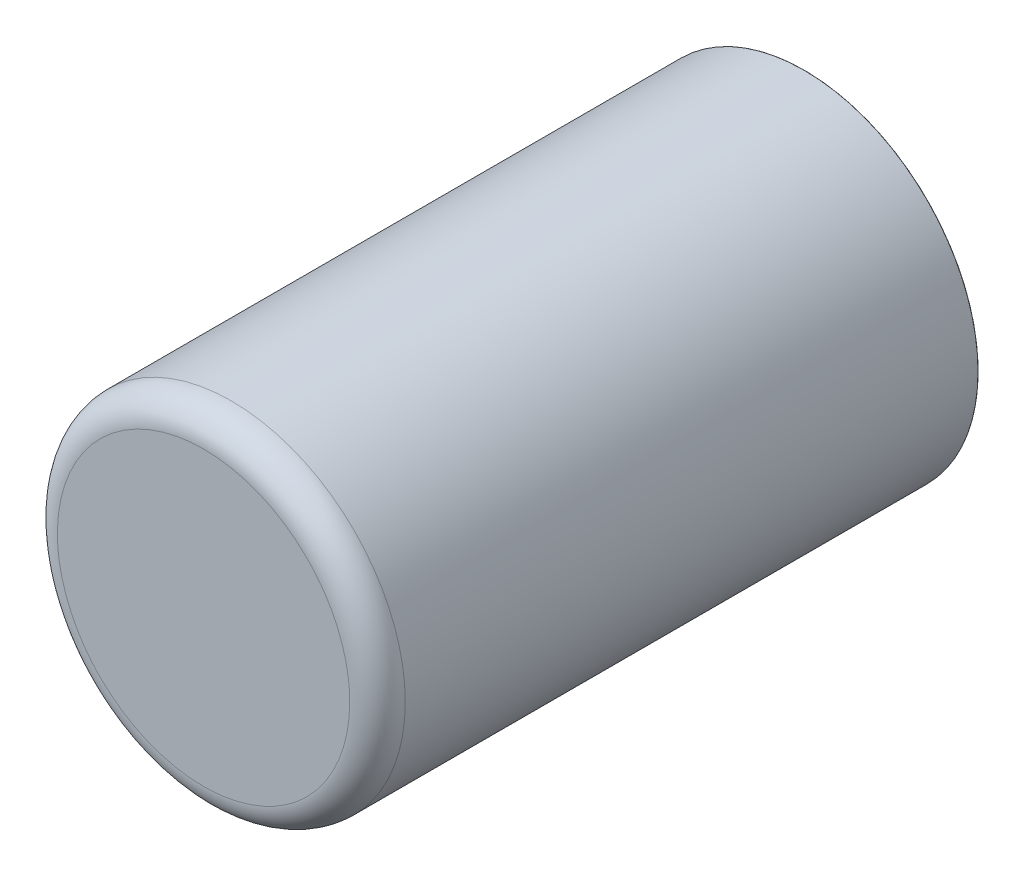
ISO-10303-21;
HEADER;
FILE_DESCRIPTION(('STEP AP214'),'2;1');
FILE_NAME('part.step','',(''),(''),'','','');
FILE_SCHEMA(('AUTOMOTIVE_DESIGN { 1 0 10303 214 1 1 1 1 }'));
ENDSEC;
DATA;
#1=APPLICATION_CONTEXT('core data for automotive mechanical design processes');
#2=APPLICATION_PROTOCOL_DEFINITION('international standard','automotive_design',2000,#1);
#3=PRODUCT_CONTEXT('',#1,'mechanical');
#4=PRODUCT('Part','Part','',(#3));
#5=PRODUCT_RELATED_PRODUCT_CATEGORY('part','',(#4));
#6=PRODUCT_DEFINITION_FORMATION('','',#4);
#7=PRODUCT_DEFINITION_CONTEXT('part definition',#1,'design');
#8=PRODUCT_DEFINITION('design','',#6,#7);
#9=PRODUCT_DEFINITION_SHAPE('','',#8);
#10=(LENGTH_UNIT() NAMED_UNIT(*) SI_UNIT(.MILLI.,.METRE.));
#11=(NAMED_UNIT(*) PLANE_ANGLE_UNIT() SI_UNIT($,.RADIAN.));
#12=(NAMED_UNIT(*) SI_UNIT($,.STERADIAN.) SOLID_ANGLE_UNIT());
#13=UNCERTAINTY_MEASURE_WITH_UNIT(LENGTH_MEASURE(1.E-05),#10,'distance_accuracy_value','');
#14=(GEOMETRIC_REPRESENTATION_CONTEXT(3) GLOBAL_UNCERTAINTY_ASSIGNED_CONTEXT((#13)) GLOBAL_UNIT_ASSIGNED_CONTEXT((#10,
#11,#12)) REPRESENTATION_CONTEXT('',''));
#15=CARTESIAN_POINT('',(0.,0.,0.));
#16=DIRECTION('',(0.,0.,1.));
#17=DIRECTION('',(1.,0.,0.));
#18=AXIS2_PLACEMENT_3D('',#15,#16,#17);
#19=CARTESIAN_POINT('',(-110.435261655171,-75.8999546142996,2.66200106833791));
#20=DIRECTION('',(0.,0.,1.));
#21=DIRECTION('',(1.,0.,0.));
#22=AXIS2_PLACEMENT_3D('',#19,#20,#21);
#23=PLANE('',#22);
#24=CARTESIAN_POINT('',(-110.435261655171,-75.8999546142996,2.6620010683379));
#25=DIRECTION('',(0.,0.,-1.));
#26=DIRECTION('',(-1.,0.,0.));
#27=AXIS2_PLACEMENT_3D('',#24,#25,#26);
#28=CIRCLE('',#27,2.37683452338597);
#29=CARTESIAN_POINT('',(-112.812096178557,-75.8999546142996,2.6620010683379));
#30=VERTEX_POINT('',#29);
#31=EDGE_CURVE('E22',#30,#30,#28,.T.);
#32=ORIENTED_EDGE('',*,*,#31,.T.);
#33=EDGE_LOOP('',(#32));
#34=FACE_BOUND('',#33,.T.);
#35=ADVANCED_FACE('F17',(#34),#23,.F.);
#36=CARTESIAN_POINT('',(-109.435261655171,-75.8999546142996,10.8846821663603));
#37=DIRECTION('',(0.,0.,1.));
#38=DIRECTION('',(1.,0.,0.));
#39=AXIS2_PLACEMENT_3D('',#36,#37,#38);
#40=PLANE('',#39);
#41=CARTESIAN_POINT('',(-110.435261655171,-77.8999546142996,10.8846821663603));
#42=CARTESIAN_POINT('',(-110.465904588904,-77.8999551480532,10.8846821663603));
#43=CARTESIAN_POINT('',(-110.496547480114,-77.8992503923736,10.8846821663603));
#44=CARTESIAN_POINT('',(-110.557768556746,-77.8964341344223,10.8846821663603));
#45=CARTESIAN_POINT('',(-110.588346742167,-77.8943226321504,10.8846821663603));
#46=CARTESIAN_POINT('',(-110.649373786479,-77.8886967132883,10.8846821663603));
#47=CARTESIAN_POINT('',(-110.679822645371,-77.885182296698,10.8846821663603));
#48=CARTESIAN_POINT('',(-110.740526725687,-77.8767581411369,10.8846821663603));
#49=CARTESIAN_POINT('',(-110.770781947112,-77.8718484021661,10.8846821663603));
#50=CARTESIAN_POINT('',(-110.831034840782,-77.8606439278679,10.8846821663603));
#51=CARTESIAN_POINT('',(-110.861032513027,-77.8543491925405,10.8846821663603));
#52=CARTESIAN_POINT('',(-110.920706943266,-77.8403880342324,10.8846821663603));
#53=CARTESIAN_POINT('',(-110.950383701261,-77.8327216112518,10.8846821663603));
#54=CARTESIAN_POINT('',(-111.009353615184,-77.8160332688263,10.8846821663603));
#55=CARTESIAN_POINT('',(-111.038646771113,-77.8070113493815,10.8846821663603));
#56=CARTESIAN_POINT('',(-111.096787603297,-77.7876310714197,10.8846821663603));
#57=CARTESIAN_POINT('',(-111.125635279551,-77.7772727129029,10.8846821663603));
#58=CARTESIAN_POINT('',(-111.182824216795,-77.7552414405414,10.8846821663603));
#59=CARTESIAN_POINT('',(-111.211165477784,-77.7435685266967,10.8846821663604));
#60=CARTESIAN_POINT('',(-111.267281714701,-77.7189327880121,10.8846821663603));
#61=CARTESIAN_POINT('',(-111.295056690629,-77.7059699631722,10.8846821663601));
#62=CARTESIAN_POINT('',(-111.349981698533,-77.6787818331058,10.8846821663605));
#63=CARTESIAN_POINT('',(-111.37713173051,-77.6645565278794,10.884682166361));
#64=CARTESIAN_POINT('',(-111.430749456801,-77.6348733045376,10.8846821663596));
#65=CARTESIAN_POINT('',(-111.457217151117,-77.6194153864222,10.8846821663579));
#66=CARTESIAN_POINT('',(-111.509414454686,-77.5873002666312,10.8846821663627));
#67=CARTESIAN_POINT('',(-111.53514406394,-77.5706430649555,10.8846821663694));
#68=CARTESIAN_POINT('',(-111.585810244106,-77.5361620381118,10.8846821663512));
#69=CARTESIAN_POINT('',(-111.610746815018,-77.5183382129436,10.8846821663262));
#70=CARTESIAN_POINT('',(-111.651933868338,-77.4874521760436,10.8846821663835));
#71=CARTESIAN_POINT('',(-111.668411023554,-77.4746908326352,10.8846821664339));
#72=CARTESIAN_POINT('',(-111.700964535644,-77.4486663325826,10.8846821659172));
#73=CARTESIAN_POINT('',(-111.717040893293,-77.4354031769108,10.8846821653501));
#74=CARTESIAN_POINT('',(-111.748776354375,-77.4083864180759,10.8846821614596));
#75=CARTESIAN_POINT('',(-111.764435453612,-77.3946328099833,10.8846821581363));
#76=CARTESIAN_POINT('',(-111.795321909948,-77.366648806898,10.8846821446602));
#77=CARTESIAN_POINT('',(-111.810549257521,-77.3524184014016,10.8846821345072));
#78=CARTESIAN_POINT('',(-111.848059649764,-77.316261676577,10.884682095922));
#79=CARTESIAN_POINT('',(-111.870063762706,-77.2940449564312,10.8846820608886));
#80=CARTESIAN_POINT('',(-111.913025626423,-77.248617269205,10.8846819337743));
#81=CARTESIAN_POINT('',(-111.933983295422,-77.225406224684,10.8846818416891));
#82=CARTESIAN_POINT('',(-111.961178142294,-77.193830028339,10.8846816832815));
#83=CARTESIAN_POINT('',(-111.967910709268,-77.1858882033686,10.8846816407382));
#84=CARTESIAN_POINT('',(-111.981245405692,-77.1698955351689,10.8846815645316));
#85=CARTESIAN_POINT('',(-111.987847533782,-77.1618446908041,10.8846815308684));
#86=CARTESIAN_POINT('',(-112.007457439191,-77.1375339018546,10.8846814432038));
#87=CARTESIAN_POINT('',(-112.020269202635,-77.1211151616101,10.8846814025242));
#88=CARTESIAN_POINT('',(-112.045353905247,-77.0878723584817,10.8846813702964));
#89=CARTESIAN_POINT('',(-112.057626860827,-77.071048307967,10.8846813787467));
#90=CARTESIAN_POINT('',(-112.081621580031,-77.0370131185235,10.8846814418997));
#91=CARTESIAN_POINT('',(-112.093343379264,-77.0198020047076,10.8846814965995));
#92=CARTESIAN_POINT('',(-112.116222134138,-76.9850109057634,10.8846816368279));
#93=CARTESIAN_POINT('',(-112.127379145534,-76.9674309572889,10.8846817223535));
#94=CARTESIAN_POINT('',(-112.149119817803,-76.9319230832987,10.8846818957771));
#95=CARTESIAN_POINT('',(-112.159703554809,-76.9139952044211,10.8846819836748));
#96=CARTESIAN_POINT('',(-112.18027377223,-76.8778041827511,10.8846821183583));
#97=CARTESIAN_POINT('',(-112.190260352303,-76.8595410965699,10.884682165151));
#98=CARTESIAN_POINT('',(-112.210694825176,-76.8207864137498,10.8846821676967));
#99=CARTESIAN_POINT('',(-112.221080910788,-76.800262314536,10.8846821133658));
#100=CARTESIAN_POINT('',(-112.241221890311,-76.7589087209055,10.8846820450128));
#101=CARTESIAN_POINT('',(-112.250976847532,-76.7380792573782,10.8846820309867));
#102=CARTESIAN_POINT('',(-112.267449217795,-76.7013603314946,10.8846820653723));
#103=CARTESIAN_POINT('',(-112.27431636729,-76.6855376054739,10.8846820990522));
#104=CARTESIAN_POINT('',(-112.2877343805,-76.6537551282087,10.8846821457949));
#105=CARTESIAN_POINT('',(-112.294285218553,-76.6377953659698,10.8846821588559));
#106=CARTESIAN_POINT('',(-112.304345162233,-76.6119479160198,10.8846821647895));
#107=CARTESIAN_POINT('',(-112.308039990252,-76.6021324428792,10.8846821635689));
#108=CARTESIAN_POINT('',(-112.322266552505,-76.5634675676149,10.8846821610173));
#109=CARTESIAN_POINT('',(-112.332243783547,-76.5344109934221,10.8846821640115));
#110=CARTESIAN_POINT('',(-112.346962710414,-76.4880312476781,10.8846821658476));
#111=CARTESIAN_POINT('',(-112.352157043016,-76.4708502232405,10.884682165898));
#112=CARTESIAN_POINT('',(-112.362977881413,-76.4332457241584,10.8846821661244));
#113=CARTESIAN_POINT('',(-112.368513485458,-76.4127960857787,10.8846821663214));
#114=CARTESIAN_POINT('',(-112.382460485936,-76.3578247479765,10.8846821664255));
#115=CARTESIAN_POINT('',(-112.390281123485,-76.3231505246203,10.8846821660461));
#116=CARTESIAN_POINT('',(-112.400621341281,-76.2708697608994,10.8846821655615));
#117=CARTESIAN_POINT('',(-112.403836393611,-76.2533972163602,10.8846821654141));
#118=CARTESIAN_POINT('',(-112.409800848751,-76.218372400436,10.8846821651677));
#119=CARTESIAN_POINT('',(-112.41255025273,-76.2008201292509,10.8846821650686));
#120=CARTESIAN_POINT('',(-112.418419898149,-76.1597868144021,10.8846821649368));
#121=CARTESIAN_POINT('',(-112.421358309315,-76.1362795817385,10.8846821649371));
#122=CARTESIAN_POINT('',(-112.426399999235,-76.0891759012572,10.8846821650871));
#123=CARTESIAN_POINT('',(-112.428503276873,-76.0655794533202,10.8846821652369));
#124=CARTESIAN_POINT('',(-112.431872027602,-76.0183267278838,10.8846821656112));
#125=CARTESIAN_POINT('',(-112.433137497333,-75.9946704501448,10.8846821658358));
#126=CARTESIAN_POINT('',(-112.434829332969,-75.947327577252,10.8846821662107));
#127=CARTESIAN_POINT('',(-112.435255693266,-75.9236409818966,10.8846821663611));
#128=CARTESIAN_POINT('',(-112.435266362056,-75.8812543800951,10.8846821663597));
#129=CARTESIAN_POINT('',(-112.435009034602,-75.8625542878523,10.8846821662649));
#130=CARTESIAN_POINT('',(-112.433969722452,-75.8251689707169,10.8846821659041));
#131=CARTESIAN_POINT('',(-112.433187734029,-75.8064837459308,10.8846821656382));
#132=CARTESIAN_POINT('',(-112.430055727092,-75.7504721822073,10.8846821646141));
#133=CARTESIAN_POINT('',(-112.426919667653,-75.713186647491,10.8846821636294));
#134=CARTESIAN_POINT('',(-112.418561248239,-75.6388519463082,10.8846821612019));
#135=CARTESIAN_POINT('',(-112.413338861912,-75.6018027828332,10.8846821597591));
#136=CARTESIAN_POINT('',(-112.400824161731,-75.5280546691348,10.8846821565496));
#137=CARTESIAN_POINT('',(-112.393531823911,-75.4913557229712,10.884682154783));
#138=CARTESIAN_POINT('',(-112.376900146236,-75.4184243995128,10.8846821510484));
#139=CARTESIAN_POINT('',(-112.367560784835,-75.382192027133,10.8846821490804));
#140=CARTESIAN_POINT('',(-112.346864429885,-75.310307771364,10.884682145054));
#141=CARTESIAN_POINT('',(-112.335507417223,-75.274655893477,10.8846821429956));
#142=CARTESIAN_POINT('',(-112.310811491183,-75.204044979007,10.8846821388875));
#143=CARTESIAN_POINT('',(-112.297472561117,-75.1690859482606,10.8846821368379));
#144=CARTESIAN_POINT('',(-112.268854778099,-75.0999708294303,10.8846821328348));
#145=CARTESIAN_POINT('',(-112.253575910855,-75.0658147472643,10.8846821308814));
#146=CARTESIAN_POINT('',(-112.221126346131,-74.9984131168245,10.8846821271468));
#147=CARTESIAN_POINT('',(-112.203955636703,-74.9651675743022,10.8846821253656));
#148=CARTESIAN_POINT('',(-112.167776443315,-74.8996917412889,10.8846821220394));
#149=CARTESIAN_POINT('',(-112.148767949682,-74.8674614561417,10.8846821204945));
#150=CARTESIAN_POINT('',(-112.108973036294,-74.8041176589585,10.8846821176936));
#151=CARTESIAN_POINT('',(-112.088186609053,-74.7730041516248,10.8846821164375));
#152=CARTESIAN_POINT('',(-112.044901280872,-74.711991912187,10.8846821142551));
#153=CARTESIAN_POINT('',(-112.022402374525,-74.6820931839189,10.8846821133287));
#154=CARTESIAN_POINT('',(-111.975762938209,-74.623604677116,10.8846821118349));
#155=CARTESIAN_POINT('',(-111.951622404784,-74.5950149013368,10.8846821112674));
#156=CARTESIAN_POINT('',(-111.901775738635,-74.5392343492501,10.8846821105088));
#157=CARTESIAN_POINT('',(-111.876069604263,-74.5120435744151,10.8846821103177));
#158=CARTESIAN_POINT('',(-111.823172695056,-74.4591466652079,10.8846821103177));
#159=CARTESIAN_POINT('',(-111.795981920221,-74.4334405308356,10.8846821105088));
#160=CARTESIAN_POINT('',(-111.740201368134,-74.3835938646861,10.8846821112674));
#161=CARTESIAN_POINT('',(-111.711611592353,-74.3594533312611,10.8846821118349));
#162=CARTESIAN_POINT('',(-111.653123085553,-74.3128138949454,10.8846821133287));
#163=CARTESIAN_POINT('',(-111.623224357288,-74.2903149885992,10.8846821142551));
#164=CARTESIAN_POINT('',(-111.562212117841,-74.2470296604173,10.8846821164375));
#165=CARTESIAN_POINT('',(-111.531098610495,-74.2262432331746,10.8846821176936));
#166=CARTESIAN_POINT('',(-111.467754813346,-74.1864483197908,10.8846821204945));
#167=CARTESIAN_POINT('',(-111.435524528246,-74.1674398261649,10.8846821220394));
#168=CARTESIAN_POINT('',(-111.370048695105,-74.1312606327582,10.8846821253656));
#169=CARTESIAN_POINT('',(-111.336803152408,-74.1140899233064,10.8846821271468));
#170=CARTESIAN_POINT('',(-111.269401522445,-74.0816403586487,10.8846821308814));
#171=CARTESIAN_POINT('',(-111.23524544093,-74.0663614914962,10.8846821328348));
#172=CARTESIAN_POINT('',(-111.16613032032,-74.0377437082293,10.8846821368379));
#173=CARTESIAN_POINT('',(-111.131171287144,-74.0244047778229,10.8846821388875));
#174=CARTESIAN_POINT('',(-111.060560379313,-73.9997088527119,10.8846821429956));
#175=CARTESIAN_POINT('',(-111.024908510496,-73.9883518413202,10.884682145054));
#176=CARTESIAN_POINT('',(-110.953024229948,-73.9676554829014,10.8846821490804));
#177=CARTESIAN_POINT('',(-110.916791823719,-73.9583161167626,10.8846821510484));
#178=CARTESIAN_POINT('',(-110.843860592738,-73.9416844520316,10.884682154783));
#179=CARTESIAN_POINT('',(-110.807161772898,-73.9343921318941,10.8846821565497));
#180=CARTESIAN_POINT('',(-110.733413314077,-73.9218773834047,10.884682159759));
#181=CARTESIAN_POINT('',(-110.696363679163,-73.9166549310885,10.8846821612017));
#182=CARTESIAN_POINT('',(-110.622030265971,-73.9082966919598,10.8846821636295));
#183=CARTESIAN_POINT('',(-110.584746490655,-73.9051608787919,10.8846821646146));
#184=CARTESIAN_POINT('',(-110.510062307753,-73.9009843481901,10.884682165979));
#185=CARTESIAN_POINT('',(-110.472661901768,-73.8999436020883,10.8846821663582));
#186=CARTESIAN_POINT('',(-110.435261655171,-73.8999546142996,10.8846821663603));
#187=B_SPLINE_CURVE_WITH_KNOTS('',3,(#41,#42,#43,#44,#45,#46,#47,#48,#49,#50,#51,#52,#53,#54,
#55,#56,#57,#58,#59,#60,#61,#62,#63,#64,#65,#66,#67,#68,#69,#70,#71,#72,#73,#74,#75,#76,#77,#78,
#79,#80,#81,#82,#83,#84,#85,#86,#87,#88,#89,#90,#91,#92,#93,#94,#95,#96,#97,#98,#99,#100,#101,
#102,#103,#104,#105,#106,#107,#108,#109,#110,#111,#112,#113,#114,#115,#116,#117,#118,#119,#120,
#121,#122,#123,#124,#125,#126,#127,#128,#129,#130,#131,#132,#133,#134,#135,#136,#137,#138,#139,
#140,#141,#142,#143,#144,#145,#146,#147,#148,#149,#150,#151,#152,#153,#154,#155,#156,#157,#158,
#159,#160,#161,#162,#163,#164,#165,#166,#167,#168,#169,#170,#171,#172,#173,#174,#175,#176,#177,
#178,#179,#180,#181,#182,#183,#184,#185,#186),.UNSPECIFIED.,.F.,.F.,(4,2,2,2,2,2,2,2,2,2,2,2,2,
2,2,2,2,2,2,2,2,2,2,2,2,2,2,2,2,2,2,2,2,2,2,2,2,2,2,2,2,2,2,2,2,2,2,2,2,2,2,2,2,2,2,2,2,2,2,2,2,
2,2,2,2,2,2,2,2,2,2,2,4),(0.,0.0919206375443472,0.183841275088703,0.275761912633056,
0.367682550177404,0.459603187721756,0.551523825266113,0.643444462810464,0.735365100354823,
0.827285737899168,0.919206375443525,1.01112701298787,1.10304765053223,1.19496828807657,
1.28688892562093,1.34940291526967,1.41191678379026,1.47443128080825,1.53694715591725,
1.63072053541833,1.72450123155747,1.75573486493529,1.78696882386028,1.84943460535033,
1.9118984829158,1.97435831939656,2.03681197793107,2.09925732197176,2.16169221530256,
2.23068822651021,2.299677305853,2.35142043661081,2.40316775823882,2.43462991380938,
2.52675833398753,2.58059966559367,2.64414727176677,2.75072406871985,2.80401681691384,
2.85730943155144,2.92836455354321,2.99941977050623,3.07047527238291,3.14153124911571,
3.19762948372655,3.25372811691774,3.36591547809142,3.4781042563005,3.59029433345867,
3.70248559147967,3.8146779122772,3.92687117776497,4.03906526985668,4.15126007046606,
4.26345546150683,4.3756513248927,4.48784754253738,4.60004399635461,4.71224056825811,
4.82443714016163,4.93663359397885,5.04882981162354,5.16102567500941,5.27322106605017,
5.38541586665955,5.49760995875127,5.60980322423903,5.72199554503657,5.83418680305757,
5.94637688021574,6.05856565842481,6.17075301959849,6.28293884565049),.UNSPECIFIED.);
#188=CARTESIAN_POINT('',(-110.435261713661,-77.8999546142996,10.8846821663603));
#189=VERTEX_POINT('',#188);
#190=CARTESIAN_POINT('',(-110.435262016717,-73.8999546142047,10.8846821663603));
#191=VERTEX_POINT('',#190);
#192=EDGE_CURVE('E40',#189,#191,#187,.T.);
#193=ORIENTED_EDGE('',*,*,#192,.F.);
#194=CARTESIAN_POINT('',(-108.435261655171,-75.8999546142996,10.8846821663603));
#195=CARTESIAN_POINT('',(-108.435261517958,-75.9217712343024,10.8846821663603));
#196=CARTESIAN_POINT('',(-108.435618623802,-75.943587846525,10.8846821663603));
#197=CARTESIAN_POINT('',(-108.437046336634,-75.9871977133613,10.8846821663603));
#198=CARTESIAN_POINT('',(-108.438116943622,-76.008990967975,10.8846821663603));
#199=CARTESIAN_POINT('',(-108.440970673766,-76.0525307775448,10.8846821663603));
#200=CARTESIAN_POINT('',(-108.442753796923,-76.074277332501,10.8846821663603));
#201=CARTESIAN_POINT('',(-108.44703060673,-76.1177004574164,10.8846821663603));
#202=CARTESIAN_POINT('',(-108.449524293381,-76.1393770273757,10.8846821663603));
#203=CARTESIAN_POINT('',(-108.455219571466,-76.1826369701037,10.8846821663603));
#204=CARTESIAN_POINT('',(-108.4584211629,-76.2042203428725,10.8846821663603));
#205=CARTESIAN_POINT('',(-108.465528819102,-76.2472707793051,10.8846821663603));
#206=CARTESIAN_POINT('',(-108.46943488387,-76.2687378429689,10.8846821663603));
#207=CARTESIAN_POINT('',(-108.477947304859,-76.3115326736948,10.8846821663603));
#208=CARTESIAN_POINT('',(-108.48255366108,-76.332860440757,10.8846821663603));
#209=CARTESIAN_POINT('',(-108.492461732152,-76.3753538399797,10.8846821663603));
#210=CARTESIAN_POINT('',(-108.497763447003,-76.3965194721403,10.8846821663603));
#211=CARTESIAN_POINT('',(-108.509056558183,-76.438665936869,10.8846821663603));
#212=CARTESIAN_POINT('',(-108.515047954513,-76.459646769437,10.8846821663603));
#213=CARTESIAN_POINT('',(-108.5277140129,-76.5014011681801,10.8846821663603));
#214=CARTESIAN_POINT('',(-108.534388674957,-76.522174734355,10.8846821663603));
#215=CARTESIAN_POINT('',(-108.548414117405,-76.5634923554568,10.8846821663603));
#216=CARTESIAN_POINT('',(-108.555764897797,-76.5840364103837,10.8846821663603));
#217=CARTESIAN_POINT('',(-108.571134705516,-76.6248730099005,10.8846821663603));
#218=CARTESIAN_POINT('',(-108.579153732842,-76.6451655544905,10.8846821663603));
#219=CARTESIAN_POINT('',(-108.595851447455,-76.6854774035691,10.8846821663603));
#220=CARTESIAN_POINT('',(-108.60453013474,-76.7054967080577,10.8846821663603));
#221=CARTESIAN_POINT('',(-108.622537875917,-76.7452406397591,10.8846821663603));
#222=CARTESIAN_POINT('',(-108.631866929808,-76.7649652669719,10.8846821663603));
#223=CARTESIAN_POINT('',(-108.651165414404,-76.8040987225034,10.8846821663603));
#224=CARTESIAN_POINT('',(-108.661134845108,-76.8235075508222,10.8846821663603));
#225=CARTESIAN_POINT('',(-108.68170340784,-76.8619886250811,10.8846821663603));
#226=CARTESIAN_POINT('',(-108.692302539867,-76.8810608710212,10.8846821663603));
#227=CARTESIAN_POINT('',(-108.714119155337,-76.918848357578,10.8846821663603));
#228=CARTESIAN_POINT('',(-108.725336638781,-76.9375635981948,10.8846821663603));
#229=CARTESIAN_POINT('',(-108.748377945455,-76.9746170330059,10.8846821663603));
#230=CARTESIAN_POINT('',(-108.760201768686,-76.9929552272002,10.8846821663603));
#231=CARTESIAN_POINT('',(-108.784443092446,-77.0292349334774,10.8846821663603));
#232=CARTESIAN_POINT('',(-108.796860592975,-77.0471764455603,10.8846821663603));
#233=CARTESIAN_POINT('',(-108.822275979,-77.0826435705102,10.8846821663603));
#234=CARTESIAN_POINT('',(-108.835273864497,-77.1001691833772,10.8846821663602));
#235=CARTESIAN_POINT('',(-108.86183608468,-77.134785761257,10.8846821663604));
#236=CARTESIAN_POINT('',(-108.875400419368,-77.1518767262697,10.8846821663607));
#237=CARTESIAN_POINT('',(-108.903081077523,-77.1856056389841,10.8846821663599));
#238=CARTESIAN_POINT('',(-108.91719740099,-77.2022435866856,10.8846821663589));
#239=CARTESIAN_POINT('',(-108.945966679436,-77.2350489023139,10.8846821663617));
#240=CARTESIAN_POINT('',(-108.960619634415,-77.2512162702407,10.8846821663657));
#241=CARTESIAN_POINT('',(-108.990447385135,-77.2830621664501,10.884682166355));
#242=CARTESIAN_POINT('',(-109.005622180876,-77.2987406947327,10.8846821663403));
#243=CARTESIAN_POINT('',(-109.037103363057,-77.3302250810046,10.8846821663811));
#244=CARTESIAN_POINT('',(-109.053430657956,-77.3460100363498,10.8846821664393));
#245=CARTESIAN_POINT('',(-109.086607073582,-77.3770216729275,10.8846821658843));
#246=CARTESIAN_POINT('',(-109.103456195148,-77.3922483532636,10.884682165271));
#247=CARTESIAN_POINT('',(-109.137658385369,-77.4221253174219,10.8846821610968));
#248=CARTESIAN_POINT('',(-109.155011461087,-77.4367755931609,10.8846821575359));
#249=CARTESIAN_POINT('',(-109.190201591852,-77.4654838654241,10.8846821430235));
#250=CARTESIAN_POINT('',(-109.20803865968,-77.4795418462839,10.8846821320719));
#251=CARTESIAN_POINT('',(-109.244177665893,-77.5070484159613,10.8846820990034));
#252=CARTESIAN_POINT('',(-109.262479622307,-77.5204969810883,10.8846820768861));
#253=CARTESIAN_POINT('',(-109.299524760805,-77.5467741905026,10.8846820076768));
#254=CARTESIAN_POINT('',(-109.318267965453,-77.5596028029835,10.8846819605836));
#255=CARTESIAN_POINT('',(-109.356163053823,-77.5845932233788,10.8846818576204));
#256=CARTESIAN_POINT('',(-109.375314439948,-77.5967557851421,10.8846818017607));
#257=CARTESIAN_POINT('',(-109.414034628942,-77.6203974505792,10.8846817273617));
#258=CARTESIAN_POINT('',(-109.433603433118,-77.6318765521135,10.8846817088225));
#259=CARTESIAN_POINT('',(-109.473130244433,-77.6541424653278,10.884681709825));
#260=CARTESIAN_POINT('',(-109.493088238897,-77.6649292995021,10.8846817293654));
#261=CARTESIAN_POINT('',(-109.533370350343,-77.6857919862322,10.8846818000963));
#262=CARTESIAN_POINT('',(-109.553694442281,-77.6958678871906,10.8846818512846));
#263=CARTESIAN_POINT('',(-109.594677348411,-77.7153106983459,10.8846819674004));
#264=CARTESIAN_POINT('',(-109.615336127643,-77.7246776820203,10.8846820323264));
#265=CARTESIAN_POINT('',(-109.656982249693,-77.7426374670192,10.8846821254881));
#266=CARTESIAN_POINT('',(-109.677969546295,-77.7512303761106,10.8846821537289));
#267=CARTESIAN_POINT('',(-109.727191866846,-77.7705922028528,10.8846821831918));
#268=CARTESIAN_POINT('',(-109.755516388996,-77.7811345937938,10.8846821723073));
#269=CARTESIAN_POINT('',(-109.815191599008,-77.8017813866918,10.8846821557386));
#270=CARTESIAN_POINT('',(-109.846585663781,-77.8117614851875,10.8846821506089));
#271=CARTESIAN_POINT('',(-109.900931254009,-77.8275835326177,10.8846821266401));
#272=CARTESIAN_POINT('',(-109.923774934001,-77.8338000563701,10.8846821120606));
#273=CARTESIAN_POINT('',(-109.966940523825,-77.8447169179685,10.8846820864318));
#274=CARTESIAN_POINT('',(-109.987239002382,-77.8495096501533,10.8846820751688));
#275=CARTESIAN_POINT('',(-110.025225099973,-77.8578446456229,10.8846820599607));
#276=CARTESIAN_POINT('',(-110.042894918919,-77.8614683696524,10.8846820552325));
#277=CARTESIAN_POINT('',(-110.081178034992,-77.8687730012526,10.8846820513658));
#278=CARTESIAN_POINT('',(-110.10180753922,-77.8723693167971,10.8846820532489));
#279=CARTESIAN_POINT('',(-110.143169526967,-77.8789076911966,10.8846820605249));
#280=CARTESIAN_POINT('',(-110.163902009175,-77.8818497583607,10.8846820659177));
#281=CARTESIAN_POINT('',(-110.205449412787,-77.8870752712393,10.8846820803046));
#282=CARTESIAN_POINT('',(-110.226264332411,-77.8893587311026,10.8846820892987));
#283=CARTESIAN_POINT('',(-110.267955407691,-77.8932651345698,10.88468210871));
#284=CARTESIAN_POINT('',(-110.288831561475,-77.8948880981642,10.8846821191272));
#285=CARTESIAN_POINT('',(-110.330623995971,-77.8974717729653,10.8846821388195));
#286=CARTESIAN_POINT('',(-110.351540275084,-77.8984325100322,10.8846821480947));
#287=CARTESIAN_POINT('',(-110.393391766765,-77.8996909730624,10.8846821617932));
#288=CARTESIAN_POINT('',(-110.41432697838,-77.8999887307405,10.8846821662168));
#289=CARTESIAN_POINT('',(-110.435261655171,-77.8999546142996,10.8846821663603));
#290=B_SPLINE_CURVE_WITH_KNOTS('',3,(#194,#195,#196,#197,#198,#199,#200,#201,#202,#203,#204,
#205,#206,#207,#208,#209,#210,#211,#212,#213,#214,#215,#216,#217,#218,#219,#220,#221,#222,#223,
#224,#225,#226,#227,#228,#229,#230,#231,#232,#233,#234,#235,#236,#237,#238,#239,#240,#241,#242,
#243,#244,#245,#246,#247,#248,#249,#250,#251,#252,#253,#254,#255,#256,#257,#258,#259,#260,#261,
#262,#263,#264,#265,#266,#267,#268,#269,#270,#271,#272,#273,#274,#275,#276,#277,#278,#279,#280,
#281,#282,#283,#284,#285,#286,#287,#288,#289),.UNSPECIFIED.,.F.,.F.,(4,2,2,2,2,2,2,2,2,2,2,2,2,
2,2,2,2,2,2,2,2,2,2,2,2,2,2,2,2,2,2,2,2,2,2,2,2,2,2,2,2,2,2,2,2,2,2,4),(0.,0.0654469265059503,
0.1308938530119,0.196340779517839,0.261787706023787,0.327234632529739,0.392681559035688,
0.458128485541643,0.523575412047587,0.589022338553539,0.654469265059476,0.719916191565436,
0.78536311807138,0.850810044577323,0.91625697108327,0.981703897589216,1.04715082409517,
1.11259775060112,1.17804467710706,1.24349160361302,1.30893853011896,1.37438545662491,
1.43983238313085,1.50527930963681,1.57072623614276,1.63884331719342,1.70696050762293,
1.77507865295031,1.8431985986664,1.91132119023288,1.9794472730814,2.04749458439276,
2.11554210870685,2.18358742079091,2.25162809566405,2.31966170861291,2.38768583520867,
2.47832894031889,2.57711015497748,2.64811998121805,2.71067884478555,2.76478515313311,
2.8275961396179,2.8904063283599,2.95321516766881,3.01602210586503,3.07882659127981,
3.1416280722556),.UNSPECIFIED.);
#291=CARTESIAN_POINT('',(-108.435261655171,-75.899954731276,10.8846821663603));
#292=VERTEX_POINT('',#291);
#293=EDGE_CURVE('E36',#292,#189,#290,.T.);
#294=ORIENTED_EDGE('',*,*,#293,.F.);
#295=CARTESIAN_POINT('',(-110.435261655171,-73.8999546142996,10.8846821663603));
#296=CARTESIAN_POINT('',(-110.413445035168,-73.8999544770863,10.8846821663603));
#297=CARTESIAN_POINT('',(-110.391628422946,-73.9003115829309,10.8846821663603));
#298=CARTESIAN_POINT('',(-110.348018556109,-73.9017392957629,10.8846821663603));
#299=CARTESIAN_POINT('',(-110.326225301496,-73.9028099027502,10.8846821663603));
#300=CARTESIAN_POINT('',(-110.282685491926,-73.9056636328945,10.8846821663603));
#301=CARTESIAN_POINT('',(-110.26093893697,-73.9074467560515,10.8846821663603));
#302=CARTESIAN_POINT('',(-110.217515812054,-73.9117235658589,10.8846821663603));
#303=CARTESIAN_POINT('',(-110.195839242095,-73.9142172525095,10.8846821663603));
#304=CARTESIAN_POINT('',(-110.152579299367,-73.9199125305944,10.8846821663603));
#305=CARTESIAN_POINT('',(-110.130995926598,-73.9231141220288,10.8846821663603));
#306=CARTESIAN_POINT('',(-110.087945490166,-73.9302217782309,10.8846821663603));
#307=CARTESIAN_POINT('',(-110.066478426502,-73.9341278429986,10.8846821663603));
#308=CARTESIAN_POINT('',(-110.023683595776,-73.9426402639877,10.8846821663603));
#309=CARTESIAN_POINT('',(-110.002355828714,-73.947246620209,10.8846821663603));
#310=CARTESIAN_POINT('',(-109.959862429491,-73.9571546912808,10.8846821663603));
#311=CARTESIAN_POINT('',(-109.93869679733,-73.9624564061312,10.8846821663603));
#312=CARTESIAN_POINT('',(-109.896550332602,-73.9737495173117,10.8846821663603));
#313=CARTESIAN_POINT('',(-109.875569500034,-73.9797409136418,10.8846821663603));
#314=CARTESIAN_POINT('',(-109.833815101291,-73.9924069720285,10.8846821663603));
#315=CARTESIAN_POINT('',(-109.813041535116,-73.9990816340851,10.8846821663603));
#316=CARTESIAN_POINT('',(-109.771723914014,-74.0131070765337,10.8846821663603));
#317=CARTESIAN_POINT('',(-109.751179859087,-74.0204578569256,10.8846821663603));
#318=CARTESIAN_POINT('',(-109.71034325957,-74.0358276646442,10.8846821663603));
#319=CARTESIAN_POINT('',(-109.69005071498,-74.0438466919709,10.8846821663603));
#320=CARTESIAN_POINT('',(-109.649738865902,-74.0605444065832,10.8846821663603));
#321=CARTESIAN_POINT('',(-109.629719561413,-74.069223093869,10.8846821663603));
#322=CARTESIAN_POINT('',(-109.589975629712,-74.0872308350455,10.8846821663603));
#323=CARTESIAN_POINT('',(-109.570251002499,-74.0965598889363,10.8846821663603));
#324=CARTESIAN_POINT('',(-109.531117546967,-74.1158583735321,10.8846821663603));
#325=CARTESIAN_POINT('',(-109.511708718648,-74.125827804237,10.8846821663603));
#326=CARTESIAN_POINT('',(-109.47322764439,-74.1463963669688,10.8846821663603));
#327=CARTESIAN_POINT('',(-109.454155398449,-74.1569954989956,10.8846821663603));
#328=CARTESIAN_POINT('',(-109.416367911893,-74.1788121144659,10.8846821663603));
#329=CARTESIAN_POINT('',(-109.397652671276,-74.1900295979093,10.8846821663603));
#330=CARTESIAN_POINT('',(-109.360599236465,-74.2130709045836,10.8846821663603));
#331=CARTESIAN_POINT('',(-109.34226104227,-74.2248947278145,10.8846821663603));
#332=CARTESIAN_POINT('',(-109.305981335993,-74.2491360515745,10.8846821663603));
#333=CARTESIAN_POINT('',(-109.28803982391,-74.2615535521037,10.8846821663603));
#334=CARTESIAN_POINT('',(-109.25257269896,-74.286968938129,10.8846821663603));
#335=CARTESIAN_POINT('',(-109.235047086093,-74.2999668236252,10.8846821663602));
#336=CARTESIAN_POINT('',(-109.200430508214,-74.3265290438091,10.8846821663604));
#337=CARTESIAN_POINT('',(-109.183339543201,-74.3400933784968,10.8846821663607));
#338=CARTESIAN_POINT('',(-109.149610630487,-74.3677740366515,10.8846821663599));
#339=CARTESIAN_POINT('',(-109.132972682785,-74.3818903601185,10.8846821663589));
#340=CARTESIAN_POINT('',(-109.100167367157,-74.4106596385648,10.8846821663617));
#341=CARTESIAN_POINT('',(-109.08399999923,-74.425312593544,10.8846821663657));
#342=CARTESIAN_POINT('',(-109.052154103021,-74.4551403442639,10.884682166355));
#343=CARTESIAN_POINT('',(-109.036475574738,-74.4703151400046,10.8846821663403));
#344=CARTESIAN_POINT('',(-109.004991188467,-74.5017963221844,10.8846821663811));
#345=CARTESIAN_POINT('',(-108.989206233123,-74.5181236170824,10.8846821664393));
#346=CARTESIAN_POINT('',(-108.958194596547,-74.5513000327068,10.8846821658843));
#347=CARTESIAN_POINT('',(-108.942967916212,-74.5681491542711,10.884682165271));
#348=CARTESIAN_POINT('',(-108.913090952056,-74.6023513444906,10.8846821610968));
#349=CARTESIAN_POINT('',(-108.898440676318,-74.6197044202071,10.8846821575359));
#350=CARTESIAN_POINT('',(-108.869732404057,-74.6548945509705,10.8846821430235));
#351=CARTESIAN_POINT('',(-108.855674423198,-74.6727316187972,10.8846821320719));
#352=CARTESIAN_POINT('',(-108.828167853523,-74.7088706250082,10.8846820990034));
#353=CARTESIAN_POINT('',(-108.814719288396,-74.7271725814218,10.8846820768861));
#354=CARTESIAN_POINT('',(-108.788442078984,-74.7642177199173,10.8846820076768));
#355=CARTESIAN_POINT('',(-108.775613466504,-74.782960924564,10.8846819605836));
#356=CARTESIAN_POINT('',(-108.75062304611,-74.8208560129345,10.8846818576204));
#357=CARTESIAN_POINT('',(-108.738460484346,-74.8400073990603,10.8846818017607));
#358=CARTESIAN_POINT('',(-108.714818818907,-74.878727588057,10.8846817273617));
#359=CARTESIAN_POINT('',(-108.703339717373,-74.8982963922343,10.8846817088225));
#360=CARTESIAN_POINT('',(-108.681073804157,-74.9378232035507,10.884681709825));
#361=CARTESIAN_POINT('',(-108.670286969981,-74.9577811980161,10.8846817293654));
#362=CARTESIAN_POINT('',(-108.649424283249,-74.9980633094643,10.8846818000963));
#363=CARTESIAN_POINT('',(-108.63934838229,-75.0183874014036,10.8846818512846));
#364=CARTESIAN_POINT('',(-108.619905571132,-75.0593703075352,10.8846819674004));
#365=CARTESIAN_POINT('',(-108.610538587456,-75.0800290867678,10.8846820323264));
#366=CARTESIAN_POINT('',(-108.592578802455,-75.1216752088196,10.8846821254881));
#367=CARTESIAN_POINT('',(-108.583985893363,-75.1426625054236,10.8846821537289));
#368=CARTESIAN_POINT('',(-108.564624066783,-75.1918848255468,10.8846821831918));
#369=CARTESIAN_POINT('',(-108.554081675988,-75.2202093472609,10.8846821723073));
#370=CARTESIAN_POINT('',(-108.533434883048,-75.2798845572527,10.8846821557386));
#371=CARTESIAN_POINT('',(-108.523454784408,-75.3112786224549,10.8846821506089));
#372=CARTESIAN_POINT('',(-108.50763273656,-75.3656242141305,10.8846821266401));
#373=CARTESIAN_POINT('',(-108.501416212549,-75.3884678951457,10.8846821120606));
#374=CARTESIAN_POINT('',(-108.490499350761,-75.4316334860081,10.8846820864318));
#375=CARTESIAN_POINT('',(-108.485706618608,-75.4519319645722,10.8846820751688));
#376=CARTESIAN_POINT('',(-108.477371623425,-75.4899180611449,10.8846820599607));
#377=CARTESIAN_POINT('',(-108.473747899621,-75.5075878790584,10.8846820552325));
#378=CARTESIAN_POINT('',(-108.466443268217,-75.5458709940957,10.8846820513658));
#379=CARTESIAN_POINT('',(-108.462846952673,-75.5665004983256,10.8846820532489));
#380=CARTESIAN_POINT('',(-108.456308578273,-75.6078624860758,10.8846820605249));
#381=CARTESIAN_POINT('',(-108.453366511109,-75.628594968285,10.8846820659177));
#382=CARTESIAN_POINT('',(-108.44814099823,-75.6701423718999,10.8846820803046));
#383=CARTESIAN_POINT('',(-108.445857538366,-75.6909572915248,10.8846820892987));
#384=CARTESIAN_POINT('',(-108.441951134899,-75.7326483668078,10.88468210871));
#385=CARTESIAN_POINT('',(-108.440328171305,-75.7535245205932,10.8846821191272));
#386=CARTESIAN_POINT('',(-108.437744496504,-75.7953169550923,10.8846821388195));
#387=CARTESIAN_POINT('',(-108.436783759437,-75.816233234207,10.8846821480947));
#388=CARTESIAN_POINT('',(-108.435525296408,-75.8580847258911,10.8846821617932));
#389=CARTESIAN_POINT('',(-108.43522753873,-75.8790199375068,10.8846821662168));
#390=CARTESIAN_POINT('',(-108.435261655171,-75.8999546142996,10.8846821663603));
#391=B_SPLINE_CURVE_WITH_KNOTS('',3,(#295,#296,#297,#298,#299,#300,#301,#302,#303,#304,#305,
#306,#307,#308,#309,#310,#311,#312,#313,#314,#315,#316,#317,#318,#319,#320,#321,#322,#323,#324,
#325,#326,#327,#328,#329,#330,#331,#332,#333,#334,#335,#336,#337,#338,#339,#340,#341,#342,#343,
#344,#345,#346,#347,#348,#349,#350,#351,#352,#353,#354,#355,#356,#357,#358,#359,#360,#361,#362,
#363,#364,#365,#366,#367,#368,#369,#370,#371,#372,#373,#374,#375,#376,#377,#378,#379,#380,#381,
#382,#383,#384,#385,#386,#387,#388,#389,#390),.UNSPECIFIED.,.F.,.F.,(4,2,2,2,2,2,2,2,2,2,2,2,2,
2,2,2,2,2,2,2,2,2,2,2,2,2,2,2,2,2,2,2,2,2,2,2,2,2,2,2,2,2,2,2,2,2,2,4),(0.,0.0654469265059503,
0.1308938530119,0.196340779517839,0.261787706023787,0.327234632529739,0.392681559035688,
0.45812848554164,0.523575412047588,0.589022338553526,0.654469265059476,0.719916191565419,
0.78536311807138,0.850810044577324,0.91625697108327,0.981703897589216,1.04715082409517,
1.11259775060111,1.17804467710706,1.24349160361301,1.30893853011896,1.37438545662491,
1.43983238313085,1.50527930963681,1.57072623614275,1.63884331718913,1.70696050761436,
1.77507865293747,1.84319859864926,1.91132119021142,1.97944727305561,2.04749458437088,
2.11554210868889,2.18358742077693,2.25162809565414,2.31966170860717,2.38768583520724,
2.4783289389419,2.57711015495799,2.64811998436071,2.71067884792613,2.76478515310701,
2.82759613959619,2.89040632834253,2.95321516765578,3.01602210585628,3.07882659127531,
3.14162807225532),.UNSPECIFIED.);
#392=EDGE_CURVE('E42',#191,#292,#391,.T.);
#393=ORIENTED_EDGE('',*,*,#392,.F.);
#394=EDGE_LOOP('',(#193,#294,#393));
#395=FACE_BOUND('',#394,.T.);
#396=ADVANCED_FACE('F41',(#395),#40,.T.);
#397=CARTESIAN_POINT('',(-110.435261655171,-75.8999546142996,1.93052713870437));
#398=DIRECTION('',(0.,0.,-1.));
#399=DIRECTION('',(-1.,0.,0.));
#400=AXIS2_PLACEMENT_3D('',#397,#398,#399);
#401=TOROIDAL_SURFACE('',#400,3.46382852407312,1.31019466769766);
#402=CARTESIAN_POINT('',(-110.435261655171,-75.8999546142996,2.66668323469821));
#403=DIRECTION('',(0.,0.,1.));
#404=DIRECTION('',(1.,0.,0.));
#405=AXIS2_PLACEMENT_3D('',#402,#403,#404);
#406=CIRCLE('',#405,2.38000000000001);
#407=CARTESIAN_POINT('',(-108.055261655171,-75.8999546142996,2.66668323469821));
#408=VERTEX_POINT('',#407);
#409=EDGE_CURVE('E28',#408,#408,#406,.T.);
#410=ORIENTED_EDGE('',*,*,#409,.F.);
#411=EDGE_LOOP('',(#410));
#412=FACE_BOUND('',#411,.T.);
#413=ORIENTED_EDGE('',*,*,#31,.F.);
#414=EDGE_LOOP('',(#413));
#415=FACE_BOUND('',#414,.T.);
#416=ADVANCED_FACE('F70',(#412,#415),#401,.F.);
#417=CARTESIAN_POINT('',(-110.435261655171,-75.8999546142996,10.5046821663603));
#418=DIRECTION('',(0.,0.,-1.));
#419=DIRECTION('',(-1.,0.,0.));
#420=AXIS2_PLACEMENT_3D('',#417,#418,#419);
#421=TOROIDAL_SURFACE('',#420,2.00000000000002,0.380000000000003);
#422=CARTESIAN_POINT('',(-110.435261655171,-75.8999546142996,10.5046821663603));
#423=DIRECTION('',(0.,0.,1.));
#424=DIRECTION('',(1.,0.,0.));
#425=AXIS2_PLACEMENT_3D('',#422,#423,#424);
#426=CIRCLE('',#425,2.38000000000001);
#427=CARTESIAN_POINT('',(-108.055261655171,-75.8999546142996,10.5046821663603));
#428=VERTEX_POINT('',#427);
#429=EDGE_CURVE('E11',#428,#428,#426,.F.);
#430=ORIENTED_EDGE('',*,*,#429,.F.);
#431=EDGE_LOOP('',(#430));
#432=FACE_BOUND('',#431,.T.);
#433=ORIENTED_EDGE('',*,*,#392,.T.);
#434=ORIENTED_EDGE('',*,*,#293,.T.);
#435=ORIENTED_EDGE('',*,*,#192,.T.);
#436=EDGE_LOOP('',(#433,#434,#435));
#437=FACE_BOUND('',#436,.T.);
#438=ADVANCED_FACE('F19',(#432,#437),#421,.T.);
#439=CARTESIAN_POINT('',(-110.435261655171,-75.8999546142996,6.56674571399566));
#440=DIRECTION('',(0.,0.,1.));
#441=DIRECTION('',(1.,0.,0.));
#442=AXIS2_PLACEMENT_3D('',#439,#440,#441);
#443=CYLINDRICAL_SURFACE('',#442,2.38000000000001);
#444=ORIENTED_EDGE('',*,*,#429,.T.);
#445=EDGE_LOOP('',(#444));
#446=FACE_BOUND('',#445,.T.);
#447=ORIENTED_EDGE('',*,*,#409,.T.);
#448=EDGE_LOOP('',(#447));
#449=FACE_BOUND('',#448,.T.);
#450=ADVANCED_FACE('F68',(#446,#449),#443,.T.);
#451=CLOSED_SHELL('',(#35,#396,#416,#438,#450));
#452=MANIFOLD_SOLID_BREP('B1',#451);
#453=ADVANCED_BREP_SHAPE_REPRESENTATION('',(#18,#452),#14);
#454=SHAPE_DEFINITION_REPRESENTATION(#9,#453);
ENDSEC;
END-ISO-10303-21;
